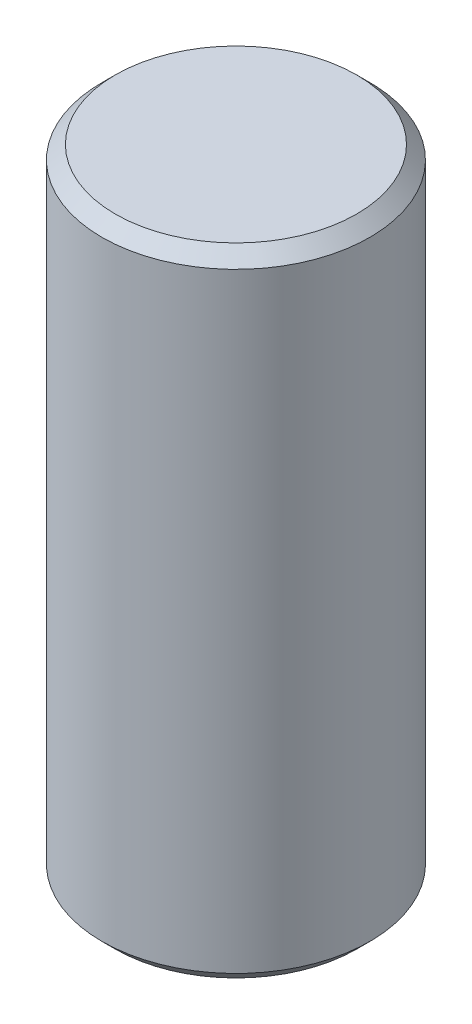
ISO-10303-21;
HEADER;
FILE_DESCRIPTION(('STEP AP214'),'2;1');
FILE_NAME('part.step','',(''),(''),'','','');
FILE_SCHEMA(('AUTOMOTIVE_DESIGN { 1 0 10303 214 1 1 1 1 }'));
ENDSEC;
DATA;
#1=APPLICATION_CONTEXT('core data for automotive mechanical design processes');
#2=APPLICATION_PROTOCOL_DEFINITION('international standard','automotive_design',2000,#1);
#3=PRODUCT_CONTEXT('',#1,'mechanical');
#4=PRODUCT('Part','Part','',(#3));
#5=PRODUCT_RELATED_PRODUCT_CATEGORY('part','',(#4));
#6=PRODUCT_DEFINITION_FORMATION('','',#4);
#7=PRODUCT_DEFINITION_CONTEXT('part definition',#1,'design');
#8=PRODUCT_DEFINITION('design','',#6,#7);
#9=PRODUCT_DEFINITION_SHAPE('','',#8);
#10=(LENGTH_UNIT() NAMED_UNIT(*) SI_UNIT(.MILLI.,.METRE.));
#11=(NAMED_UNIT(*) PLANE_ANGLE_UNIT() SI_UNIT($,.RADIAN.));
#12=(NAMED_UNIT(*) SI_UNIT($,.STERADIAN.) SOLID_ANGLE_UNIT());
#13=UNCERTAINTY_MEASURE_WITH_UNIT(LENGTH_MEASURE(1.E-05),#10,'distance_accuracy_value','');
#14=(GEOMETRIC_REPRESENTATION_CONTEXT(3) GLOBAL_UNCERTAINTY_ASSIGNED_CONTEXT((#13)) GLOBAL_UNIT_ASSIGNED_CONTEXT((#10,
#11,#12)) REPRESENTATION_CONTEXT('',''));
#15=CARTESIAN_POINT('',(0.,0.,0.));
#16=DIRECTION('',(0.,0.,1.));
#17=DIRECTION('',(1.,0.,0.));
#18=AXIS2_PLACEMENT_3D('',#15,#16,#17);
#19=CARTESIAN_POINT('',(0.,1.1875,0.));
#20=DIRECTION('',(0.,-1.,0.));
#21=DIRECTION('',(0.,0.,-1.));
#22=AXIS2_PLACEMENT_3D('',#19,#20,#21);
#23=CYLINDRICAL_SURFACE('',#22,0.5);
#24=CARTESIAN_POINT('',(0.,-1.1375,0.));
#25=DIRECTION('',(0.,1.,0.));
#26=DIRECTION('',(0.,0.,1.));
#27=AXIS2_PLACEMENT_3D('',#24,#25,#26);
#28=CIRCLE('',#27,0.5);
#29=CARTESIAN_POINT('',(0.,-1.1375,0.5));
#30=VERTEX_POINT('',#29);
#31=EDGE_CURVE('E57',#30,#30,#28,.T.);
#32=ORIENTED_EDGE('',*,*,#31,.T.);
#33=EDGE_LOOP('',(#32));
#34=FACE_BOUND('',#33,.T.);
#35=CARTESIAN_POINT('',(0.,1.1375,0.));
#36=DIRECTION('',(0.,1.,0.));
#37=DIRECTION('',(0.,0.,1.));
#38=AXIS2_PLACEMENT_3D('',#35,#36,#37);
#39=CIRCLE('',#38,0.5);
#40=CARTESIAN_POINT('',(0.,1.1375,0.5));
#41=VERTEX_POINT('',#40);
#42=EDGE_CURVE('E62',#41,#41,#39,.F.);
#43=ORIENTED_EDGE('',*,*,#42,.T.);
#44=EDGE_LOOP('',(#43));
#45=FACE_BOUND('',#44,.T.);
#46=ADVANCED_FACE('F43',(#34,#45),#23,.T.);
#47=CARTESIAN_POINT('',(0.,1.1875,0.));
#48=DIRECTION('',(0.,1.,0.));
#49=DIRECTION('',(0.,0.,1.));
#50=AXIS2_PLACEMENT_3D('',#47,#48,#49);
#51=PLANE('',#50);
#52=CARTESIAN_POINT('',(0.,1.1875,0.));
#53=DIRECTION('',(0.,1.,0.));
#54=DIRECTION('',(0.,0.,1.));
#55=AXIS2_PLACEMENT_3D('',#52,#53,#54);
#56=CIRCLE('',#55,0.45);
#57=CARTESIAN_POINT('',(0.,1.1875,0.45));
#58=VERTEX_POINT('',#57);
#59=EDGE_CURVE('E10',#58,#58,#56,.T.);
#60=ORIENTED_EDGE('',*,*,#59,.T.);
#61=EDGE_LOOP('',(#60));
#62=FACE_BOUND('',#61,.T.);
#63=ADVANCED_FACE('F79',(#62),#51,.T.);
#64=CARTESIAN_POINT('',(0.,-1.1875,0.));
#65=DIRECTION('',(0.,1.,0.));
#66=DIRECTION('',(0.,0.,1.));
#67=AXIS2_PLACEMENT_3D('',#64,#65,#66);
#68=PLANE('',#67);
#69=CARTESIAN_POINT('',(0.,-1.1875,0.));
#70=DIRECTION('',(0.,1.,0.));
#71=DIRECTION('',(0.,0.,1.));
#72=AXIS2_PLACEMENT_3D('',#69,#70,#71);
#73=CIRCLE('',#72,0.45);
#74=CARTESIAN_POINT('',(0.,-1.1875,0.45));
#75=VERTEX_POINT('',#74);
#76=EDGE_CURVE('E52',#75,#75,#73,.F.);
#77=ORIENTED_EDGE('',*,*,#76,.T.);
#78=EDGE_LOOP('',(#77));
#79=FACE_BOUND('',#78,.T.);
#80=ADVANCED_FACE('F76',(#79),#68,.F.);
#81=CARTESIAN_POINT('',(0.,-1.1375,0.));
#82=DIRECTION('',(0.,1.,0.));
#83=DIRECTION('',(0.,0.,1.));
#84=AXIS2_PLACEMENT_3D('',#81,#82,#83);
#85=CONICAL_SURFACE('',#84,0.5,0.785398163397453);
#86=ORIENTED_EDGE('',*,*,#76,.F.);
#87=EDGE_LOOP('',(#86));
#88=FACE_BOUND('',#87,.T.);
#89=ORIENTED_EDGE('',*,*,#31,.F.);
#90=EDGE_LOOP('',(#89));
#91=FACE_BOUND('',#90,.T.);
#92=ADVANCED_FACE('F72',(#88,#91),#85,.T.);
#93=CARTESIAN_POINT('',(0.,1.1875,0.));
#94=DIRECTION('',(0.,-1.,0.));
#95=DIRECTION('',(0.,0.,-1.));
#96=AXIS2_PLACEMENT_3D('',#93,#94,#95);
#97=CONICAL_SURFACE('',#96,0.45,0.785398163397448);
#98=ORIENTED_EDGE('',*,*,#42,.F.);
#99=EDGE_LOOP('',(#98));
#100=FACE_BOUND('',#99,.T.);
#101=ORIENTED_EDGE('',*,*,#59,.F.);
#102=EDGE_LOOP('',(#101));
#103=FACE_BOUND('',#102,.T.);
#104=ADVANCED_FACE('F46',(#100,#103),#97,.T.);
#105=CLOSED_SHELL('',(#46,#63,#80,#92,#104));
#106=MANIFOLD_SOLID_BREP('B2',#105);
#107=ADVANCED_BREP_SHAPE_REPRESENTATION('',(#18,#106),#14);
#108=SHAPE_DEFINITION_REPRESENTATION(#9,#107);
ENDSEC;
END-ISO-10303-21;
